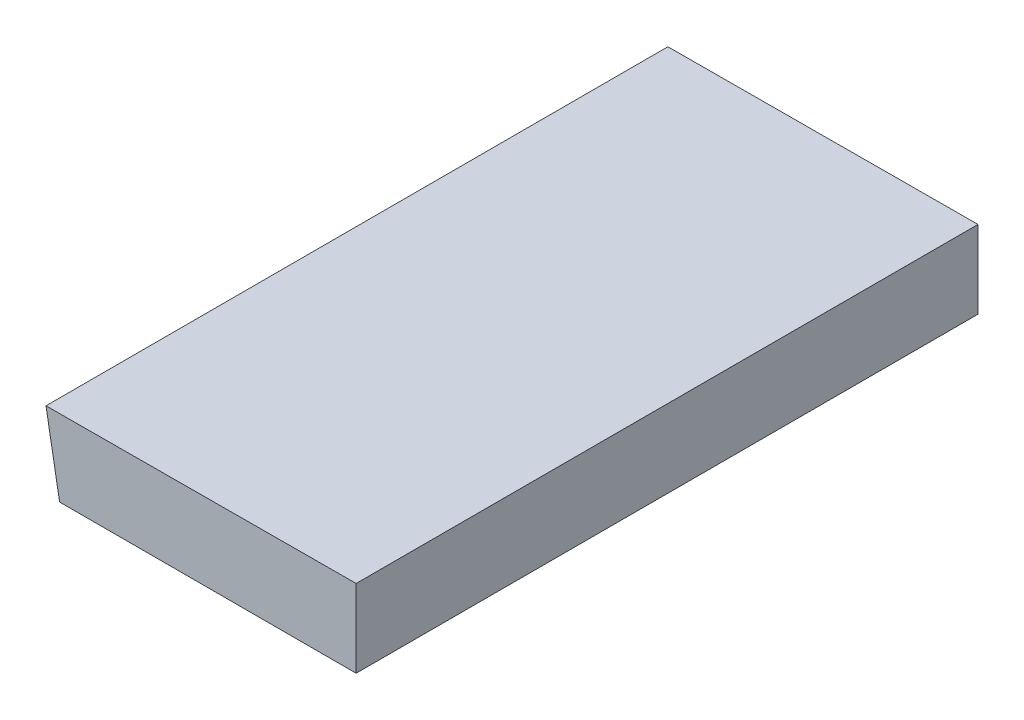
ISO-10303-21;
HEADER;
FILE_DESCRIPTION(('STEP AP214'),'2;1');
FILE_NAME('part.step','',(''),(''),'','','');
FILE_SCHEMA(('AUTOMOTIVE_DESIGN { 1 0 10303 214 1 1 1 1 }'));
ENDSEC;
DATA;
#1=APPLICATION_CONTEXT('core data for automotive mechanical design processes');
#2=APPLICATION_PROTOCOL_DEFINITION('international standard','automotive_design',2000,#1);
#3=PRODUCT_CONTEXT('',#1,'mechanical');
#4=PRODUCT('Part','Part','',(#3));
#5=PRODUCT_RELATED_PRODUCT_CATEGORY('part','',(#4));
#6=PRODUCT_DEFINITION_FORMATION('','',#4);
#7=PRODUCT_DEFINITION_CONTEXT('part definition',#1,'design');
#8=PRODUCT_DEFINITION('design','',#6,#7);
#9=PRODUCT_DEFINITION_SHAPE('','',#8);
#10=(LENGTH_UNIT() NAMED_UNIT(*) SI_UNIT(.MILLI.,.METRE.));
#11=(NAMED_UNIT(*) PLANE_ANGLE_UNIT() SI_UNIT($,.RADIAN.));
#12=(NAMED_UNIT(*) SI_UNIT($,.STERADIAN.) SOLID_ANGLE_UNIT());
#13=UNCERTAINTY_MEASURE_WITH_UNIT(LENGTH_MEASURE(1.E-05),#10,'distance_accuracy_value','');
#14=(GEOMETRIC_REPRESENTATION_CONTEXT(3) GLOBAL_UNCERTAINTY_ASSIGNED_CONTEXT((#13)) GLOBAL_UNIT_ASSIGNED_CONTEXT((#10,
#11,#12)) REPRESENTATION_CONTEXT('',''));
#15=CARTESIAN_POINT('',(0.,0.,0.));
#16=DIRECTION('',(0.,0.,1.));
#17=DIRECTION('',(1.,0.,0.));
#18=AXIS2_PLACEMENT_3D('',#15,#16,#17);
#19=CARTESIAN_POINT('',(0.,0.,6.35));
#20=DIRECTION('',(0.984601200404339,0.174815548971864,0.));
#21=DIRECTION('',(-0.174815548971864,0.984601200404339,0.));
#22=AXIS2_PLACEMENT_3D('',#19,#20,#21);
#23=PLANE('',#22);
#24=DIRECTION('',(0.174815548971864,-0.984601200404339,0.));
#25=VECTOR('',#24,1.);
#26=CARTESIAN_POINT('',(0.,0.,0.));
#27=LINE('',#26,#25);
#28=CARTESIAN_POINT('',(-0.13880354588366,0.781773353121045,0.));
#29=VERTEX_POINT('',#28);
#30=CARTESIAN_POINT('',(0.,0.,0.));
#31=VERTEX_POINT('',#30);
#32=EDGE_CURVE('E96',#29,#31,#27,.T.);
#33=ORIENTED_EDGE('',*,*,#32,.T.);
#34=DIRECTION('',(0.,0.,-1.));
#35=VECTOR('',#34,1.);
#36=CARTESIAN_POINT('',(0.,0.,6.35));
#37=LINE('',#36,#35);
#38=CARTESIAN_POINT('',(0.,0.,6.35));
#39=VERTEX_POINT('',#38);
#40=EDGE_CURVE('E11',#39,#31,#37,.T.);
#41=ORIENTED_EDGE('',*,*,#40,.F.);
#42=DIRECTION('',(0.174815548971864,-0.984601200404339,0.));
#43=VECTOR('',#42,1.);
#44=CARTESIAN_POINT('',(0.,0.,6.35));
#45=LINE('',#44,#43);
#46=CARTESIAN_POINT('',(-0.13880354588366,0.781773353121045,6.35));
#47=VERTEX_POINT('',#46);
#48=EDGE_CURVE('E84',#47,#39,#45,.T.);
#49=ORIENTED_EDGE('',*,*,#48,.F.);
#50=DIRECTION('',(0.,0.,-1.));
#51=VECTOR('',#50,1.);
#52=CARTESIAN_POINT('',(-0.13880354588366,0.781773353121045,6.35));
#53=LINE('',#52,#51);
#54=EDGE_CURVE('E92',#47,#29,#53,.T.);
#55=ORIENTED_EDGE('',*,*,#54,.T.);
#56=EDGE_LOOP('',(#33,#41,#49,#55));
#57=FACE_BOUND('',#56,.T.);
#58=ADVANCED_FACE('F33',(#57),#23,.F.);
#59=CARTESIAN_POINT('',(0.,0.,6.35));
#60=DIRECTION('',(0.,1.,0.));
#61=DIRECTION('',(0.,0.,1.));
#62=AXIS2_PLACEMENT_3D('',#59,#60,#61);
#63=PLANE('',#62);
#64=DIRECTION('',(1.,0.,0.));
#65=VECTOR('',#64,1.);
#66=CARTESIAN_POINT('',(0.,0.,0.));
#67=LINE('',#66,#65);
#68=CARTESIAN_POINT('',(3.02795104,0.,0.));
#69=VERTEX_POINT('',#68);
#70=EDGE_CURVE('E88',#31,#69,#67,.T.);
#71=ORIENTED_EDGE('',*,*,#70,.T.);
#72=DIRECTION('',(0.,0.,-1.));
#73=VECTOR('',#72,1.);
#74=CARTESIAN_POINT('',(3.02795104,0.,6.35));
#75=LINE('',#74,#73);
#76=CARTESIAN_POINT('',(3.02795104,0.,6.35));
#77=VERTEX_POINT('',#76);
#78=EDGE_CURVE('E41',#77,#69,#75,.T.);
#79=ORIENTED_EDGE('',*,*,#78,.F.);
#80=DIRECTION('',(1.,0.,0.));
#81=VECTOR('',#80,1.);
#82=CARTESIAN_POINT('',(0.,0.,6.35));
#83=LINE('',#82,#81);
#84=EDGE_CURVE('E79',#39,#77,#83,.T.);
#85=ORIENTED_EDGE('',*,*,#84,.F.);
#86=ORIENTED_EDGE('',*,*,#40,.T.);
#87=EDGE_LOOP('',(#71,#79,#85,#86));
#88=FACE_BOUND('',#87,.T.);
#89=ADVANCED_FACE('F87',(#88),#63,.F.);
#90=CARTESIAN_POINT('',(3.02795104,0.,6.35));
#91=DIRECTION('',(-1.,0.,0.));
#92=DIRECTION('',(0.,0.,1.));
#93=AXIS2_PLACEMENT_3D('',#90,#91,#92);
#94=PLANE('',#93);
#95=DIRECTION('',(0.,1.,0.));
#96=VECTOR('',#95,1.);
#97=CARTESIAN_POINT('',(3.02795104,0.,0.));
#98=LINE('',#97,#96);
#99=CARTESIAN_POINT('',(3.02795104,0.794,0.));
#100=VERTEX_POINT('',#99);
#101=EDGE_CURVE('E66',#69,#100,#98,.T.);
#102=ORIENTED_EDGE('',*,*,#101,.T.);
#103=DIRECTION('',(0.,0.,-1.));
#104=VECTOR('',#103,1.);
#105=CARTESIAN_POINT('',(3.02795104,0.794,6.35));
#106=LINE('',#105,#104);
#107=CARTESIAN_POINT('',(3.02795104,0.794,6.35));
#108=VERTEX_POINT('',#107);
#109=EDGE_CURVE('E89',#108,#100,#106,.T.);
#110=ORIENTED_EDGE('',*,*,#109,.F.);
#111=DIRECTION('',(0.,1.,0.));
#112=VECTOR('',#111,1.);
#113=CARTESIAN_POINT('',(3.02795104,0.,6.35));
#114=LINE('',#113,#112);
#115=EDGE_CURVE('E82',#77,#108,#114,.T.);
#116=ORIENTED_EDGE('',*,*,#115,.F.);
#117=ORIENTED_EDGE('',*,*,#78,.T.);
#118=EDGE_LOOP('',(#102,#110,#116,#117));
#119=FACE_BOUND('',#118,.T.);
#120=ADVANCED_FACE('F90',(#119),#94,.F.);
#121=CARTESIAN_POINT('',(-0.13880354588366,0.781773353121045,6.35));
#122=DIRECTION('',(0.00386091041095235,-0.999992546657623,0.));
#123=DIRECTION('',(0.999992546657623,0.00386091041095235,0.));
#124=AXIS2_PLACEMENT_3D('',#121,#122,#123);
#125=PLANE('',#124);
#126=DIRECTION('',(-0.999992546657623,-0.00386091041095235,0.));
#127=VECTOR('',#126,1.);
#128=CARTESIAN_POINT('',(-0.13880354588366,0.781773353121045,0.));
#129=LINE('',#128,#127);
#130=EDGE_CURVE('E72',#100,#29,#129,.T.);
#131=ORIENTED_EDGE('',*,*,#130,.T.);
#132=ORIENTED_EDGE('',*,*,#54,.F.);
#133=DIRECTION('',(-0.999992546657623,-0.00386091041095235,0.));
#134=VECTOR('',#133,1.);
#135=CARTESIAN_POINT('',(-0.13880354588366,0.781773353121045,6.35));
#136=LINE('',#135,#134);
#137=EDGE_CURVE('E49',#108,#47,#136,.T.);
#138=ORIENTED_EDGE('',*,*,#137,.F.);
#139=ORIENTED_EDGE('',*,*,#109,.T.);
#140=EDGE_LOOP('',(#131,#132,#138,#139));
#141=FACE_BOUND('',#140,.T.);
#142=ADVANCED_FACE('F103',(#141),#125,.F.);
#143=CARTESIAN_POINT('',(0.,0.,6.35));
#144=DIRECTION('',(0.,0.,-1.));
#145=DIRECTION('',(-1.,0.,0.));
#146=AXIS2_PLACEMENT_3D('',#143,#144,#145);
#147=PLANE('',#146);
#148=ORIENTED_EDGE('',*,*,#48,.T.);
#149=ORIENTED_EDGE('',*,*,#84,.T.);
#150=ORIENTED_EDGE('',*,*,#115,.T.);
#151=ORIENTED_EDGE('',*,*,#137,.T.);
#152=EDGE_LOOP('',(#148,#149,#150,#151));
#153=FACE_BOUND('',#152,.T.);
#154=ADVANCED_FACE('F80',(#153),#147,.F.);
#155=CARTESIAN_POINT('',(0.,0.,0.));
#156=DIRECTION('',(0.,0.,-1.));
#157=DIRECTION('',(-1.,0.,0.));
#158=AXIS2_PLACEMENT_3D('',#155,#156,#157);
#159=PLANE('',#158);
#160=ORIENTED_EDGE('',*,*,#32,.F.);
#161=ORIENTED_EDGE('',*,*,#130,.F.);
#162=ORIENTED_EDGE('',*,*,#101,.F.);
#163=ORIENTED_EDGE('',*,*,#70,.F.);
#164=EDGE_LOOP('',(#160,#161,#162,#163));
#165=FACE_BOUND('',#164,.T.);
#166=ADVANCED_FACE('F106',(#165),#159,.T.);
#167=CLOSED_SHELL('',(#58,#89,#120,#142,#154,#166));
#168=MANIFOLD_SOLID_BREP('B2',#167);
#169=ADVANCED_BREP_SHAPE_REPRESENTATION('',(#18,#168),#14);
#170=SHAPE_DEFINITION_REPRESENTATION(#9,#169);
ENDSEC;
END-ISO-10303-21;
